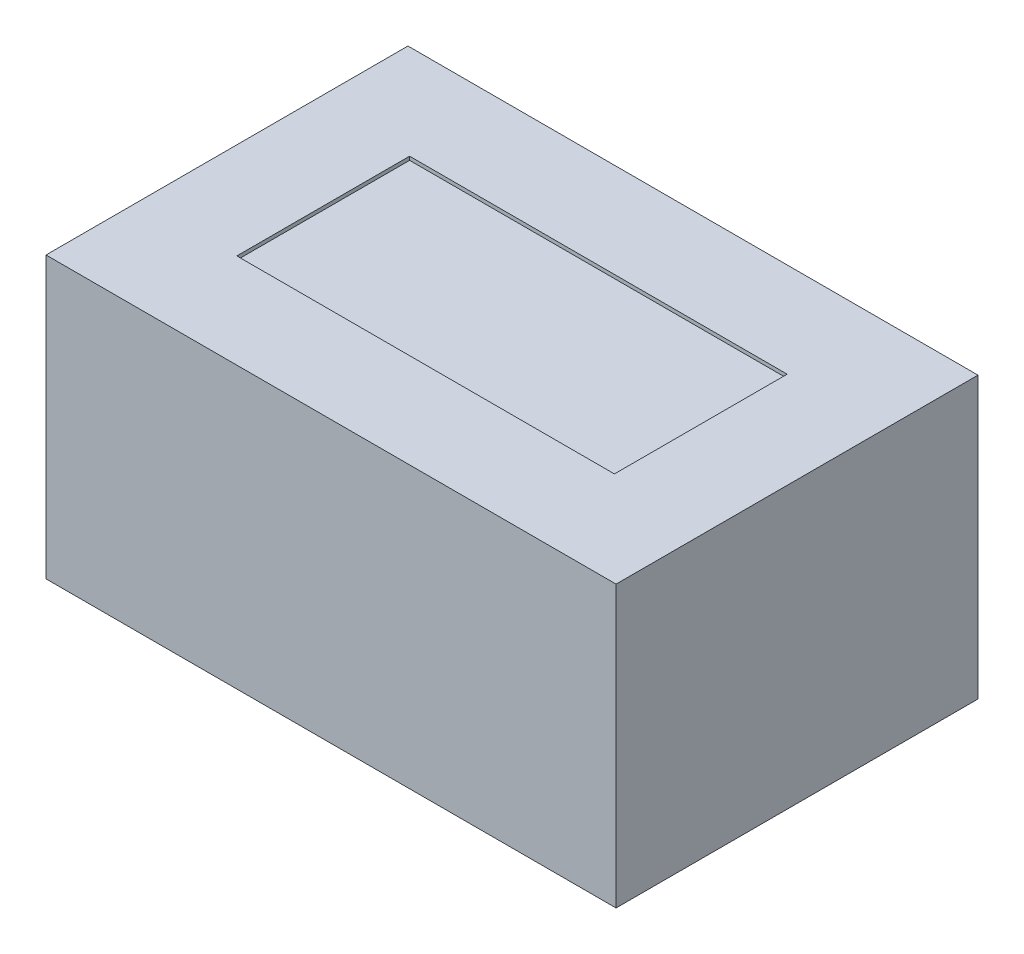
ISO-10303-21;
HEADER;
FILE_DESCRIPTION(('STEP AP214'),'2;1');
FILE_NAME('part.step','',(''),(''),'','','');
FILE_SCHEMA(('AUTOMOTIVE_DESIGN { 1 0 10303 214 1 1 1 1 }'));
ENDSEC;
DATA;
#1=APPLICATION_CONTEXT('core data for automotive mechanical design processes');
#2=APPLICATION_PROTOCOL_DEFINITION('international standard','automotive_design',2000,#1);
#3=PRODUCT_CONTEXT('',#1,'mechanical');
#4=PRODUCT('Part','Part','',(#3));
#5=PRODUCT_RELATED_PRODUCT_CATEGORY('part','',(#4));
#6=PRODUCT_DEFINITION_FORMATION('','',#4);
#7=PRODUCT_DEFINITION_CONTEXT('part definition',#1,'design');
#8=PRODUCT_DEFINITION('design','',#6,#7);
#9=PRODUCT_DEFINITION_SHAPE('','',#8);
#10=(LENGTH_UNIT() NAMED_UNIT(*) SI_UNIT(.MILLI.,.METRE.));
#11=(NAMED_UNIT(*) PLANE_ANGLE_UNIT() SI_UNIT($,.RADIAN.));
#12=(NAMED_UNIT(*) SI_UNIT($,.STERADIAN.) SOLID_ANGLE_UNIT());
#13=UNCERTAINTY_MEASURE_WITH_UNIT(LENGTH_MEASURE(1.E-05),#10,'distance_accuracy_value','');
#14=(GEOMETRIC_REPRESENTATION_CONTEXT(3) GLOBAL_UNCERTAINTY_ASSIGNED_CONTEXT((#13)) GLOBAL_UNIT_ASSIGNED_CONTEXT((#10,
#11,#12)) REPRESENTATION_CONTEXT('',''));
#15=CARTESIAN_POINT('',(0.,0.,0.));
#16=DIRECTION('',(0.,0.,1.));
#17=DIRECTION('',(1.,0.,0.));
#18=AXIS2_PLACEMENT_3D('',#15,#16,#17);
#19=CARTESIAN_POINT('',(157.5,155.,100.));
#20=DIRECTION('',(-1.,0.,0.));
#21=DIRECTION('',(0.,0.,1.));
#22=AXIS2_PLACEMENT_3D('',#19,#20,#21);
#23=PLANE('',#22);
#24=DIRECTION('',(0.,0.,-1.));
#25=VECTOR('',#24,1.);
#26=CARTESIAN_POINT('',(157.5,0.,100.));
#27=LINE('',#26,#25);
#28=CARTESIAN_POINT('',(157.5,0.,100.));
#29=VERTEX_POINT('',#28);
#30=CARTESIAN_POINT('',(157.5,0.,-100.));
#31=VERTEX_POINT('',#30);
#32=EDGE_CURVE('E141',#29,#31,#27,.T.);
#33=ORIENTED_EDGE('',*,*,#32,.T.);
#34=DIRECTION('',(0.,-1.,0.));
#35=VECTOR('',#34,1.);
#36=CARTESIAN_POINT('',(157.5,155.,-100.));
#37=LINE('',#36,#35);
#38=CARTESIAN_POINT('',(157.5,155.,-100.));
#39=VERTEX_POINT('',#38);
#40=EDGE_CURVE('E11',#39,#31,#37,.T.);
#41=ORIENTED_EDGE('',*,*,#40,.F.);
#42=DIRECTION('',(0.,0.,-1.));
#43=VECTOR('',#42,1.);
#44=CARTESIAN_POINT('',(157.5,155.,100.));
#45=LINE('',#44,#43);
#46=CARTESIAN_POINT('',(157.5,155.,100.));
#47=VERTEX_POINT('',#46);
#48=EDGE_CURVE('E145',#47,#39,#45,.T.);
#49=ORIENTED_EDGE('',*,*,#48,.F.);
#50=DIRECTION('',(0.,-1.,0.));
#51=VECTOR('',#50,1.);
#52=CARTESIAN_POINT('',(157.5,155.,100.));
#53=LINE('',#52,#51);
#54=EDGE_CURVE('E151',#47,#29,#53,.T.);
#55=ORIENTED_EDGE('',*,*,#54,.T.);
#56=EDGE_LOOP('',(#33,#41,#49,#55));
#57=FACE_BOUND('',#56,.T.);
#58=ADVANCED_FACE('F33',(#57),#23,.F.);
#59=CARTESIAN_POINT('',(-157.5,155.,-100.));
#60=DIRECTION('',(0.,0.,1.));
#61=DIRECTION('',(1.,0.,0.));
#62=AXIS2_PLACEMENT_3D('',#59,#60,#61);
#63=PLANE('',#62);
#64=DIRECTION('',(-1.,0.,0.));
#65=VECTOR('',#64,1.);
#66=CARTESIAN_POINT('',(-157.5,0.,-100.));
#67=LINE('',#66,#65);
#68=CARTESIAN_POINT('',(-157.5,0.,-100.));
#69=VERTEX_POINT('',#68);
#70=EDGE_CURVE('E154',#31,#69,#67,.T.);
#71=ORIENTED_EDGE('',*,*,#70,.T.);
#72=DIRECTION('',(0.,-1.,0.));
#73=VECTOR('',#72,1.);
#74=CARTESIAN_POINT('',(-157.5,155.,-100.));
#75=LINE('',#74,#73);
#76=CARTESIAN_POINT('',(-157.5,155.,-100.));
#77=VERTEX_POINT('',#76);
#78=EDGE_CURVE('E40',#77,#69,#75,.T.);
#79=ORIENTED_EDGE('',*,*,#78,.F.);
#80=DIRECTION('',(-1.,0.,0.));
#81=VECTOR('',#80,1.);
#82=CARTESIAN_POINT('',(-157.5,155.,-100.));
#83=LINE('',#82,#81);
#84=EDGE_CURVE('E84',#39,#77,#83,.T.);
#85=ORIENTED_EDGE('',*,*,#84,.F.);
#86=ORIENTED_EDGE('',*,*,#40,.T.);
#87=EDGE_LOOP('',(#71,#79,#85,#86));
#88=FACE_BOUND('',#87,.T.);
#89=ADVANCED_FACE('F184',(#88),#63,.F.);
#90=CARTESIAN_POINT('',(-157.5,155.,100.));
#91=DIRECTION('',(1.,0.,0.));
#92=DIRECTION('',(0.,0.,-1.));
#93=AXIS2_PLACEMENT_3D('',#90,#91,#92);
#94=PLANE('',#93);
#95=DIRECTION('',(0.,0.,1.));
#96=VECTOR('',#95,1.);
#97=CARTESIAN_POINT('',(-157.5,0.,100.));
#98=LINE('',#97,#96);
#99=CARTESIAN_POINT('',(-157.5,0.,100.));
#100=VERTEX_POINT('',#99);
#101=EDGE_CURVE('E156',#69,#100,#98,.T.);
#102=ORIENTED_EDGE('',*,*,#101,.T.);
#103=DIRECTION('',(0.,-1.,0.));
#104=VECTOR('',#103,1.);
#105=CARTESIAN_POINT('',(-157.5,155.,100.));
#106=LINE('',#105,#104);
#107=CARTESIAN_POINT('',(-157.5,155.,100.));
#108=VERTEX_POINT('',#107);
#109=EDGE_CURVE('E160',#108,#100,#106,.T.);
#110=ORIENTED_EDGE('',*,*,#109,.F.);
#111=DIRECTION('',(0.,0.,1.));
#112=VECTOR('',#111,1.);
#113=CARTESIAN_POINT('',(-157.5,155.,100.));
#114=LINE('',#113,#112);
#115=EDGE_CURVE('E148',#77,#108,#114,.T.);
#116=ORIENTED_EDGE('',*,*,#115,.F.);
#117=ORIENTED_EDGE('',*,*,#78,.T.);
#118=EDGE_LOOP('',(#102,#110,#116,#117));
#119=FACE_BOUND('',#118,.T.);
#120=ADVANCED_FACE('F165',(#119),#94,.F.);
#121=CARTESIAN_POINT('',(-157.5,155.,100.));
#122=DIRECTION('',(0.,0.,-1.));
#123=DIRECTION('',(-1.,0.,0.));
#124=AXIS2_PLACEMENT_3D('',#121,#122,#123);
#125=PLANE('',#124);
#126=DIRECTION('',(1.,0.,0.));
#127=VECTOR('',#126,1.);
#128=CARTESIAN_POINT('',(-157.5,0.,100.));
#129=LINE('',#128,#127);
#130=EDGE_CURVE('E77',#100,#29,#129,.T.);
#131=ORIENTED_EDGE('',*,*,#130,.T.);
#132=ORIENTED_EDGE('',*,*,#54,.F.);
#133=DIRECTION('',(1.,0.,0.));
#134=VECTOR('',#133,1.);
#135=CARTESIAN_POINT('',(-157.5,155.,100.));
#136=LINE('',#135,#134);
#137=EDGE_CURVE('E56',#108,#47,#136,.T.);
#138=ORIENTED_EDGE('',*,*,#137,.F.);
#139=ORIENTED_EDGE('',*,*,#109,.T.);
#140=EDGE_LOOP('',(#131,#132,#138,#139));
#141=FACE_BOUND('',#140,.T.);
#142=ADVANCED_FACE('F173',(#141),#125,.F.);
#143=CARTESIAN_POINT('',(0.,155.,0.));
#144=DIRECTION('',(0.,-1.,0.));
#145=DIRECTION('',(0.,0.,-1.));
#146=AXIS2_PLACEMENT_3D('',#143,#144,#145);
#147=PLANE('',#146);
#148=DIRECTION('',(-1.,0.,0.));
#149=VECTOR('',#148,1.);
#150=CARTESIAN_POINT('',(-104.324355942142,155.,-47.7333138037164));
#151=LINE('',#150,#149);
#152=CARTESIAN_POINT('',(104.324355942142,155.,-47.7333138037164));
#153=VERTEX_POINT('',#152);
#154=CARTESIAN_POINT('',(-104.324355942142,155.,-47.7333138037164));
#155=VERTEX_POINT('',#154);
#156=EDGE_CURVE('E135',#153,#155,#151,.T.);
#157=ORIENTED_EDGE('',*,*,#156,.F.);
#158=DIRECTION('',(0.,0.,-1.));
#159=VECTOR('',#158,1.);
#160=CARTESIAN_POINT('',(104.324355942142,155.,47.7333138037164));
#161=LINE('',#160,#159);
#162=CARTESIAN_POINT('',(104.324355942142,155.,47.7333138037164));
#163=VERTEX_POINT('',#162);
#164=EDGE_CURVE('E47',#163,#153,#161,.T.);
#165=ORIENTED_EDGE('',*,*,#164,.F.);
#166=DIRECTION('',(1.,0.,0.));
#167=VECTOR('',#166,1.);
#168=CARTESIAN_POINT('',(-104.324355942142,155.,47.7333138037164));
#169=LINE('',#168,#167);
#170=CARTESIAN_POINT('',(-104.324355942142,155.,47.7333138037164));
#171=VERTEX_POINT('',#170);
#172=EDGE_CURVE('E126',#171,#163,#169,.T.);
#173=ORIENTED_EDGE('',*,*,#172,.F.);
#174=DIRECTION('',(0.,0.,1.));
#175=VECTOR('',#174,1.);
#176=CARTESIAN_POINT('',(-104.324355942142,155.,47.7333138037164));
#177=LINE('',#176,#175);
#178=EDGE_CURVE('E129',#155,#171,#177,.T.);
#179=ORIENTED_EDGE('',*,*,#178,.F.);
#180=EDGE_LOOP('',(#157,#165,#173,#179));
#181=FACE_BOUND('',#180,.T.);
#182=ORIENTED_EDGE('',*,*,#48,.T.);
#183=ORIENTED_EDGE('',*,*,#84,.T.);
#184=ORIENTED_EDGE('',*,*,#115,.T.);
#185=ORIENTED_EDGE('',*,*,#137,.T.);
#186=EDGE_LOOP('',(#182,#183,#184,#185));
#187=FACE_BOUND('',#186,.T.);
#188=ADVANCED_FACE('F175',(#181,#187),#147,.F.);
#189=CARTESIAN_POINT('',(0.,0.,0.));
#190=DIRECTION('',(0.,-1.,0.));
#191=DIRECTION('',(0.,0.,-1.));
#192=AXIS2_PLACEMENT_3D('',#189,#190,#191);
#193=PLANE('',#192);
#194=ORIENTED_EDGE('',*,*,#32,.F.);
#195=ORIENTED_EDGE('',*,*,#130,.F.);
#196=ORIENTED_EDGE('',*,*,#101,.F.);
#197=ORIENTED_EDGE('',*,*,#70,.F.);
#198=EDGE_LOOP('',(#194,#195,#196,#197));
#199=FACE_BOUND('',#198,.T.);
#200=ADVANCED_FACE('F169',(#199),#193,.T.);
#201=CARTESIAN_POINT('',(104.324355942142,153.,47.7333138037164));
#202=DIRECTION('',(1.,0.,0.));
#203=DIRECTION('',(0.,0.,-1.));
#204=AXIS2_PLACEMENT_3D('',#201,#202,#203);
#205=PLANE('',#204);
#206=ORIENTED_EDGE('',*,*,#164,.T.);
#207=DIRECTION('',(0.,1.,0.));
#208=VECTOR('',#207,1.);
#209=CARTESIAN_POINT('',(104.324355942142,153.,-47.7333138037164));
#210=LINE('',#209,#208);
#211=CARTESIAN_POINT('',(104.324355942142,153.,-47.7333138037164));
#212=VERTEX_POINT('',#211);
#213=EDGE_CURVE('E104',#212,#153,#210,.T.);
#214=ORIENTED_EDGE('',*,*,#213,.F.);
#215=DIRECTION('',(0.,0.,-1.));
#216=VECTOR('',#215,1.);
#217=CARTESIAN_POINT('',(104.324355942142,153.,47.7333138037164));
#218=LINE('',#217,#216);
#219=CARTESIAN_POINT('',(104.324355942142,153.,47.7333138037164));
#220=VERTEX_POINT('',#219);
#221=EDGE_CURVE('E108',#220,#212,#218,.T.);
#222=ORIENTED_EDGE('',*,*,#221,.F.);
#223=DIRECTION('',(0.,1.,0.));
#224=VECTOR('',#223,1.);
#225=CARTESIAN_POINT('',(104.324355942142,153.,47.7333138037164));
#226=LINE('',#225,#224);
#227=EDGE_CURVE('E139',#220,#163,#226,.T.);
#228=ORIENTED_EDGE('',*,*,#227,.T.);
#229=EDGE_LOOP('',(#206,#214,#222,#228));
#230=FACE_BOUND('',#229,.T.);
#231=ADVANCED_FACE('F106',(#230),#205,.F.);
#232=CARTESIAN_POINT('',(-104.324355942142,153.,47.7333138037164));
#233=DIRECTION('',(0.,0.,1.));
#234=DIRECTION('',(1.,0.,0.));
#235=AXIS2_PLACEMENT_3D('',#232,#233,#234);
#236=PLANE('',#235);
#237=ORIENTED_EDGE('',*,*,#172,.T.);
#238=ORIENTED_EDGE('',*,*,#227,.F.);
#239=DIRECTION('',(1.,0.,0.));
#240=VECTOR('',#239,1.);
#241=CARTESIAN_POINT('',(-104.324355942142,153.,47.7333138037164));
#242=LINE('',#241,#240);
#243=CARTESIAN_POINT('',(-104.324355942142,153.,47.7333138037164));
#244=VERTEX_POINT('',#243);
#245=EDGE_CURVE('E114',#244,#220,#242,.T.);
#246=ORIENTED_EDGE('',*,*,#245,.F.);
#247=DIRECTION('',(0.,1.,0.));
#248=VECTOR('',#247,1.);
#249=CARTESIAN_POINT('',(-104.324355942142,153.,47.7333138037164));
#250=LINE('',#249,#248);
#251=EDGE_CURVE('E142',#244,#171,#250,.T.);
#252=ORIENTED_EDGE('',*,*,#251,.T.);
#253=EDGE_LOOP('',(#237,#238,#246,#252));
#254=FACE_BOUND('',#253,.T.);
#255=ADVANCED_FACE('F220',(#254),#236,.F.);
#256=CARTESIAN_POINT('',(-104.324355942142,153.,47.7333138037164));
#257=DIRECTION('',(-1.,0.,0.));
#258=DIRECTION('',(0.,0.,1.));
#259=AXIS2_PLACEMENT_3D('',#256,#257,#258);
#260=PLANE('',#259);
#261=ORIENTED_EDGE('',*,*,#178,.T.);
#262=ORIENTED_EDGE('',*,*,#251,.F.);
#263=DIRECTION('',(0.,0.,1.));
#264=VECTOR('',#263,1.);
#265=CARTESIAN_POINT('',(-104.324355942142,153.,47.7333138037164));
#266=LINE('',#265,#264);
#267=CARTESIAN_POINT('',(-104.324355942142,153.,-47.7333138037164));
#268=VERTEX_POINT('',#267);
#269=EDGE_CURVE('E122',#268,#244,#266,.T.);
#270=ORIENTED_EDGE('',*,*,#269,.F.);
#271=DIRECTION('',(0.,1.,0.));
#272=VECTOR('',#271,1.);
#273=CARTESIAN_POINT('',(-104.324355942142,153.,-47.7333138037164));
#274=LINE('',#273,#272);
#275=EDGE_CURVE('E113',#268,#155,#274,.T.);
#276=ORIENTED_EDGE('',*,*,#275,.T.);
#277=EDGE_LOOP('',(#261,#262,#270,#276));
#278=FACE_BOUND('',#277,.T.);
#279=ADVANCED_FACE('F229',(#278),#260,.F.);
#280=CARTESIAN_POINT('',(-104.324355942142,153.,-47.7333138037164));
#281=DIRECTION('',(0.,0.,-1.));
#282=DIRECTION('',(-1.,0.,0.));
#283=AXIS2_PLACEMENT_3D('',#280,#281,#282);
#284=PLANE('',#283);
#285=ORIENTED_EDGE('',*,*,#156,.T.);
#286=ORIENTED_EDGE('',*,*,#275,.F.);
#287=DIRECTION('',(-1.,0.,0.));
#288=VECTOR('',#287,1.);
#289=CARTESIAN_POINT('',(-104.324355942142,153.,-47.7333138037164));
#290=LINE('',#289,#288);
#291=EDGE_CURVE('E117',#212,#268,#290,.T.);
#292=ORIENTED_EDGE('',*,*,#291,.F.);
#293=ORIENTED_EDGE('',*,*,#213,.T.);
#294=EDGE_LOOP('',(#285,#286,#292,#293));
#295=FACE_BOUND('',#294,.T.);
#296=ADVANCED_FACE('F118',(#295),#284,.F.);
#297=CARTESIAN_POINT('',(0.,153.,0.));
#298=DIRECTION('',(0.,-1.,0.));
#299=DIRECTION('',(0.,0.,-1.));
#300=AXIS2_PLACEMENT_3D('',#297,#298,#299);
#301=PLANE('',#300);
#302=ORIENTED_EDGE('',*,*,#221,.T.);
#303=ORIENTED_EDGE('',*,*,#291,.T.);
#304=ORIENTED_EDGE('',*,*,#269,.T.);
#305=ORIENTED_EDGE('',*,*,#245,.T.);
#306=EDGE_LOOP('',(#302,#303,#304,#305));
#307=FACE_BOUND('',#306,.T.);
#308=ADVANCED_FACE('F124',(#307),#301,.F.);
#309=CLOSED_SHELL('',(#58,#89,#120,#142,#188,#200,#231,#255,#279,#296,#308));
#310=MANIFOLD_SOLID_BREP('B2',#309);
#311=ADVANCED_BREP_SHAPE_REPRESENTATION('',(#18,#310),#14);
#312=SHAPE_DEFINITION_REPRESENTATION(#9,#311);
ENDSEC;
END-ISO-10303-21;
